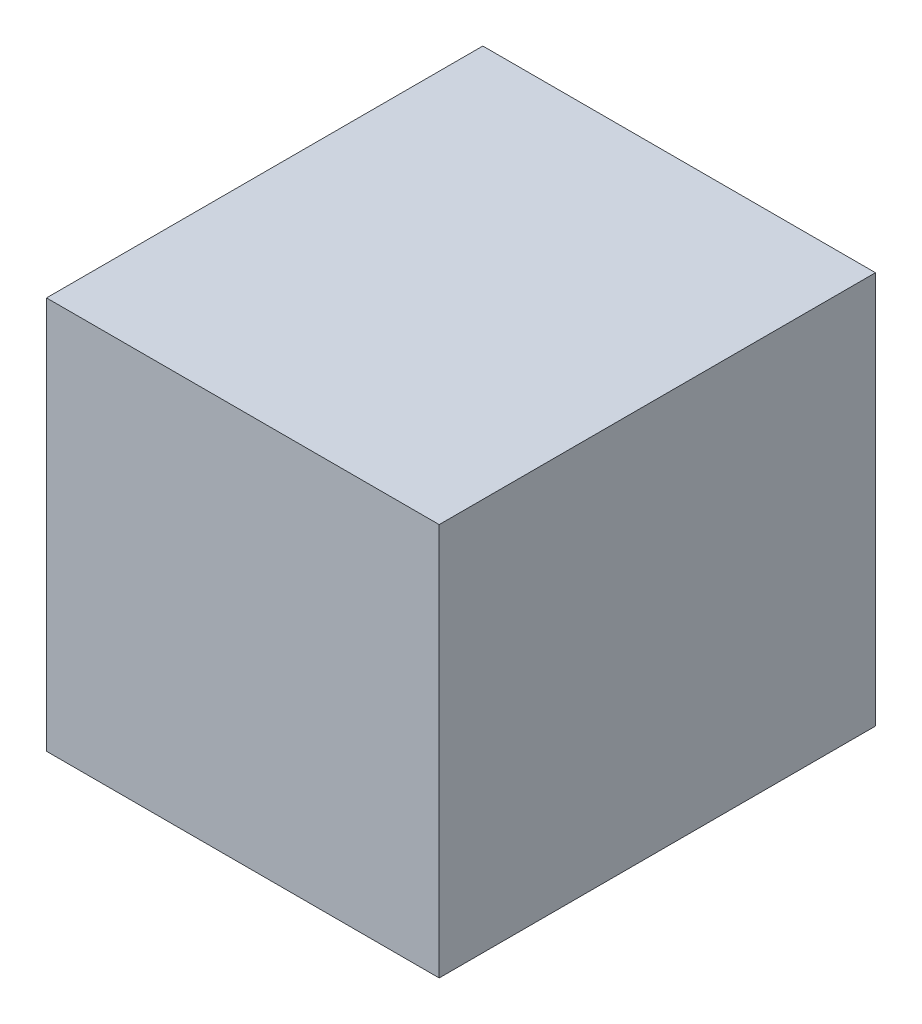
ISO-10303-21;
HEADER;
FILE_DESCRIPTION(('STEP AP214'),'2;1');
FILE_NAME('part.step','',(''),(''),'','','');
FILE_SCHEMA(('AUTOMOTIVE_DESIGN { 1 0 10303 214 1 1 1 1 }'));
ENDSEC;
DATA;
#1=APPLICATION_CONTEXT('core data for automotive mechanical design processes');
#2=APPLICATION_PROTOCOL_DEFINITION('international standard','automotive_design',2000,#1);
#3=PRODUCT_CONTEXT('',#1,'mechanical');
#4=PRODUCT('Part','Part','',(#3));
#5=PRODUCT_RELATED_PRODUCT_CATEGORY('part','',(#4));
#6=PRODUCT_DEFINITION_FORMATION('','',#4);
#7=PRODUCT_DEFINITION_CONTEXT('part definition',#1,'design');
#8=PRODUCT_DEFINITION('design','',#6,#7);
#9=PRODUCT_DEFINITION_SHAPE('','',#8);
#10=(LENGTH_UNIT() NAMED_UNIT(*) SI_UNIT(.MILLI.,.METRE.));
#11=(NAMED_UNIT(*) PLANE_ANGLE_UNIT() SI_UNIT($,.RADIAN.));
#12=(NAMED_UNIT(*) SI_UNIT($,.STERADIAN.) SOLID_ANGLE_UNIT());
#13=UNCERTAINTY_MEASURE_WITH_UNIT(LENGTH_MEASURE(1.E-05),#10,'distance_accuracy_value','');
#14=(GEOMETRIC_REPRESENTATION_CONTEXT(3) GLOBAL_UNCERTAINTY_ASSIGNED_CONTEXT((#13)) GLOBAL_UNIT_ASSIGNED_CONTEXT((#10,
#11,#12)) REPRESENTATION_CONTEXT('',''));
#15=CARTESIAN_POINT('',(0.,0.,0.));
#16=DIRECTION('',(0.,0.,1.));
#17=DIRECTION('',(1.,0.,0.));
#18=AXIS2_PLACEMENT_3D('',#15,#16,#17);
#19=CARTESIAN_POINT('',(-21.6,-21.6,48.));
#20=DIRECTION('',(1.,0.,0.));
#21=DIRECTION('',(0.,0.,-1.));
#22=AXIS2_PLACEMENT_3D('',#19,#20,#21);
#23=PLANE('',#22);
#24=DIRECTION('',(0.,-1.,0.));
#25=VECTOR('',#24,1.);
#26=CARTESIAN_POINT('',(-21.6,-21.6,0.));
#27=LINE('',#26,#25);
#28=CARTESIAN_POINT('',(-21.6,21.6,0.));
#29=VERTEX_POINT('',#28);
#30=CARTESIAN_POINT('',(-21.6,-21.6,0.));
#31=VERTEX_POINT('',#30);
#32=EDGE_CURVE('E113',#29,#31,#27,.T.);
#33=ORIENTED_EDGE('',*,*,#32,.T.);
#34=DIRECTION('',(0.,0.,-1.));
#35=VECTOR('',#34,1.);
#36=CARTESIAN_POINT('',(-21.6,-21.6,48.));
#37=LINE('',#36,#35);
#38=CARTESIAN_POINT('',(-21.6,-21.6,48.));
#39=VERTEX_POINT('',#38);
#40=EDGE_CURVE('E11',#39,#31,#37,.T.);
#41=ORIENTED_EDGE('',*,*,#40,.F.);
#42=DIRECTION('',(0.,-1.,0.));
#43=VECTOR('',#42,1.);
#44=CARTESIAN_POINT('',(-21.6,-21.6,48.));
#45=LINE('',#44,#43);
#46=CARTESIAN_POINT('',(-21.6,21.6,48.));
#47=VERTEX_POINT('',#46);
#48=EDGE_CURVE('E98',#47,#39,#45,.T.);
#49=ORIENTED_EDGE('',*,*,#48,.F.);
#50=DIRECTION('',(0.,0.,-1.));
#51=VECTOR('',#50,1.);
#52=CARTESIAN_POINT('',(-21.6,21.6,48.));
#53=LINE('',#52,#51);
#54=EDGE_CURVE('E109',#47,#29,#53,.T.);
#55=ORIENTED_EDGE('',*,*,#54,.T.);
#56=EDGE_LOOP('',(#33,#41,#49,#55));
#57=FACE_BOUND('',#56,.T.);
#58=ADVANCED_FACE('F45',(#57),#23,.F.);
#59=CARTESIAN_POINT('',(21.6,-21.6,48.));
#60=DIRECTION('',(0.,1.,0.));
#61=DIRECTION('',(-1.,0.,0.));
#62=AXIS2_PLACEMENT_3D('',#59,#60,#61);
#63=PLANE('',#62);
#64=DIRECTION('',(1.,0.,0.));
#65=VECTOR('',#64,1.);
#66=CARTESIAN_POINT('',(21.6,-21.6,0.));
#67=LINE('',#66,#65);
#68=CARTESIAN_POINT('',(21.6,-21.6,0.));
#69=VERTEX_POINT('',#68);
#70=EDGE_CURVE('E103',#31,#69,#67,.T.);
#71=ORIENTED_EDGE('',*,*,#70,.T.);
#72=DIRECTION('',(0.,0.,-1.));
#73=VECTOR('',#72,1.);
#74=CARTESIAN_POINT('',(21.6,-21.6,48.));
#75=LINE('',#74,#73);
#76=CARTESIAN_POINT('',(21.6,-21.6,48.));
#77=VERTEX_POINT('',#76);
#78=EDGE_CURVE('E54',#77,#69,#75,.T.);
#79=ORIENTED_EDGE('',*,*,#78,.F.);
#80=DIRECTION('',(1.,0.,0.));
#81=VECTOR('',#80,1.);
#82=CARTESIAN_POINT('',(21.6,-21.6,48.));
#83=LINE('',#82,#81);
#84=EDGE_CURVE('E92',#39,#77,#83,.T.);
#85=ORIENTED_EDGE('',*,*,#84,.F.);
#86=ORIENTED_EDGE('',*,*,#40,.T.);
#87=EDGE_LOOP('',(#71,#79,#85,#86));
#88=FACE_BOUND('',#87,.T.);
#89=ADVANCED_FACE('F102',(#88),#63,.F.);
#90=CARTESIAN_POINT('',(21.6,-21.6,48.));
#91=DIRECTION('',(-1.,0.,0.));
#92=DIRECTION('',(0.,0.,1.));
#93=AXIS2_PLACEMENT_3D('',#90,#91,#92);
#94=PLANE('',#93);
#95=DIRECTION('',(0.,1.,0.));
#96=VECTOR('',#95,1.);
#97=CARTESIAN_POINT('',(21.6,-21.6,0.));
#98=LINE('',#97,#96);
#99=CARTESIAN_POINT('',(21.6,21.6,0.));
#100=VERTEX_POINT('',#99);
#101=EDGE_CURVE('E79',#69,#100,#98,.T.);
#102=ORIENTED_EDGE('',*,*,#101,.T.);
#103=DIRECTION('',(0.,0.,-1.));
#104=VECTOR('',#103,1.);
#105=CARTESIAN_POINT('',(21.6,21.6,48.));
#106=LINE('',#105,#104);
#107=CARTESIAN_POINT('',(21.6,21.6,48.));
#108=VERTEX_POINT('',#107);
#109=EDGE_CURVE('E105',#108,#100,#106,.T.);
#110=ORIENTED_EDGE('',*,*,#109,.F.);
#111=DIRECTION('',(0.,1.,0.));
#112=VECTOR('',#111,1.);
#113=CARTESIAN_POINT('',(21.6,-21.6,48.));
#114=LINE('',#113,#112);
#115=EDGE_CURVE('E96',#77,#108,#114,.T.);
#116=ORIENTED_EDGE('',*,*,#115,.F.);
#117=ORIENTED_EDGE('',*,*,#78,.T.);
#118=EDGE_LOOP('',(#102,#110,#116,#117));
#119=FACE_BOUND('',#118,.T.);
#120=ADVANCED_FACE('F106',(#119),#94,.F.);
#121=CARTESIAN_POINT('',(21.6,21.6,48.));
#122=DIRECTION('',(0.,-1.,0.));
#123=DIRECTION('',(1.,0.,0.));
#124=AXIS2_PLACEMENT_3D('',#121,#122,#123);
#125=PLANE('',#124);
#126=DIRECTION('',(-1.,0.,0.));
#127=VECTOR('',#126,1.);
#128=CARTESIAN_POINT('',(21.6,21.6,0.));
#129=LINE('',#128,#127);
#130=EDGE_CURVE('E85',#100,#29,#129,.T.);
#131=ORIENTED_EDGE('',*,*,#130,.T.);
#132=ORIENTED_EDGE('',*,*,#54,.F.);
#133=DIRECTION('',(-1.,0.,0.));
#134=VECTOR('',#133,1.);
#135=CARTESIAN_POINT('',(21.6,21.6,48.));
#136=LINE('',#135,#134);
#137=EDGE_CURVE('E62',#108,#47,#136,.T.);
#138=ORIENTED_EDGE('',*,*,#137,.F.);
#139=ORIENTED_EDGE('',*,*,#109,.T.);
#140=EDGE_LOOP('',(#131,#132,#138,#139));
#141=FACE_BOUND('',#140,.T.);
#142=ADVANCED_FACE('F120',(#141),#125,.F.);
#143=CARTESIAN_POINT('',(0.,0.,48.));
#144=DIRECTION('',(0.,0.,1.));
#145=DIRECTION('',(1.,0.,0.));
#146=AXIS2_PLACEMENT_3D('',#143,#144,#145);
#147=PLANE('',#146);
#148=ORIENTED_EDGE('',*,*,#48,.T.);
#149=ORIENTED_EDGE('',*,*,#84,.T.);
#150=ORIENTED_EDGE('',*,*,#115,.T.);
#151=ORIENTED_EDGE('',*,*,#137,.T.);
#152=EDGE_LOOP('',(#148,#149,#150,#151));
#153=FACE_BOUND('',#152,.T.);
#154=ADVANCED_FACE('F94',(#153),#147,.T.);
#155=CARTESIAN_POINT('',(0.,0.,0.));
#156=DIRECTION('',(0.,0.,1.));
#157=DIRECTION('',(1.,0.,0.));
#158=AXIS2_PLACEMENT_3D('',#155,#156,#157);
#159=PLANE('',#158);
#160=ORIENTED_EDGE('',*,*,#32,.F.);
#161=ORIENTED_EDGE('',*,*,#130,.F.);
#162=ORIENTED_EDGE('',*,*,#101,.F.);
#163=ORIENTED_EDGE('',*,*,#70,.F.);
#164=EDGE_LOOP('',(#160,#161,#162,#163));
#165=FACE_BOUND('',#164,.T.);
#166=ADVANCED_FACE('F123',(#165),#159,.F.);
#167=CLOSED_SHELL('',(#58,#89,#120,#142,#154,#166));
#168=MANIFOLD_SOLID_BREP('B2',#167);
#169=ADVANCED_BREP_SHAPE_REPRESENTATION('',(#18,#168),#14);
#170=SHAPE_DEFINITION_REPRESENTATION(#9,#169);
ENDSEC;
END-ISO-10303-21;
